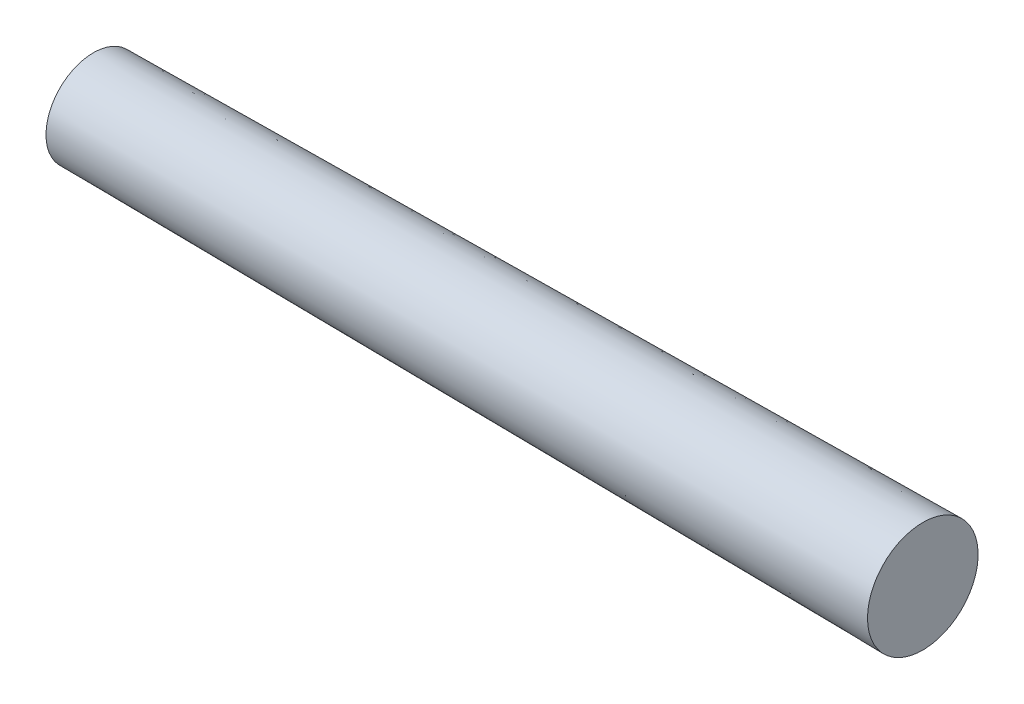
ISO-10303-21;
HEADER;
FILE_DESCRIPTION(('STEP AP214'),'2;1');
FILE_NAME('part.step','',(''),(''),'','','');
FILE_SCHEMA(('AUTOMOTIVE_DESIGN { 1 0 10303 214 1 1 1 1 }'));
ENDSEC;
DATA;
#1=APPLICATION_CONTEXT('core data for automotive mechanical design processes');
#2=APPLICATION_PROTOCOL_DEFINITION('international standard','automotive_design',2000,#1);
#3=PRODUCT_CONTEXT('',#1,'mechanical');
#4=PRODUCT('Part','Part','',(#3));
#5=PRODUCT_RELATED_PRODUCT_CATEGORY('part','',(#4));
#6=PRODUCT_DEFINITION_FORMATION('','',#4);
#7=PRODUCT_DEFINITION_CONTEXT('part definition',#1,'design');
#8=PRODUCT_DEFINITION('design','',#6,#7);
#9=PRODUCT_DEFINITION_SHAPE('','',#8);
#10=(LENGTH_UNIT() NAMED_UNIT(*) SI_UNIT(.MILLI.,.METRE.));
#11=(NAMED_UNIT(*) PLANE_ANGLE_UNIT() SI_UNIT($,.RADIAN.));
#12=(NAMED_UNIT(*) SI_UNIT($,.STERADIAN.) SOLID_ANGLE_UNIT());
#13=UNCERTAINTY_MEASURE_WITH_UNIT(LENGTH_MEASURE(1.E-05),#10,'distance_accuracy_value','');
#14=(GEOMETRIC_REPRESENTATION_CONTEXT(3) GLOBAL_UNCERTAINTY_ASSIGNED_CONTEXT((#13)) GLOBAL_UNIT_ASSIGNED_CONTEXT((#10,
#11,#12)) REPRESENTATION_CONTEXT('',''));
#15=CARTESIAN_POINT('',(0.,0.,0.));
#16=DIRECTION('',(0.,0.,1.));
#17=DIRECTION('',(1.,0.,0.));
#18=AXIS2_PLACEMENT_3D('',#15,#16,#17);
#19=CARTESIAN_POINT('',(0.,0.,0.));
#20=DIRECTION('',(1.,0.,0.));
#21=DIRECTION('',(0.,0.,-1.));
#22=AXIS2_PLACEMENT_3D('',#19,#20,#21);
#23=PLANE('',#22);
#24=CARTESIAN_POINT('',(0.,0.,0.));
#25=DIRECTION('',(-1.,0.,0.));
#26=DIRECTION('',(0.,0.,1.));
#27=AXIS2_PLACEMENT_3D('',#24,#25,#26);
#28=CIRCLE('',#27,6.);
#29=CARTESIAN_POINT('',(0.,0.,6.));
#30=VERTEX_POINT('',#29);
#31=EDGE_CURVE('E10',#30,#30,#28,.T.);
#32=ORIENTED_EDGE('',*,*,#31,.T.);
#33=EDGE_LOOP('',(#32));
#34=FACE_BOUND('',#33,.T.);
#35=ADVANCED_FACE('F35',(#34),#23,.F.);
#36=CARTESIAN_POINT('',(105.,0.,0.));
#37=DIRECTION('',(1.,0.,0.));
#38=DIRECTION('',(0.,0.,-1.));
#39=AXIS2_PLACEMENT_3D('',#36,#37,#38);
#40=CONICAL_SURFACE('',#39,7.,0.00952352159361286);
#41=ORIENTED_EDGE('',*,*,#31,.F.);
#42=EDGE_LOOP('',(#41));
#43=FACE_BOUND('',#42,.T.);
#44=CARTESIAN_POINT('',(105.,0.,0.));
#45=DIRECTION('',(-1.,0.,0.));
#46=DIRECTION('',(0.,0.,1.));
#47=AXIS2_PLACEMENT_3D('',#44,#45,#46);
#48=CIRCLE('',#47,7.);
#49=CARTESIAN_POINT('',(105.,0.,7.));
#50=VERTEX_POINT('',#49);
#51=EDGE_CURVE('E41',#50,#50,#48,.T.);
#52=ORIENTED_EDGE('',*,*,#51,.T.);
#53=EDGE_LOOP('',(#52));
#54=FACE_BOUND('',#53,.T.);
#55=ADVANCED_FACE('F47',(#43,#54),#40,.T.);
#56=CARTESIAN_POINT('',(105.,7.,0.));
#57=DIRECTION('',(-1.,0.,0.));
#58=DIRECTION('',(0.,0.,1.));
#59=AXIS2_PLACEMENT_3D('',#56,#57,#58);
#60=PLANE('',#59);
#61=ORIENTED_EDGE('',*,*,#51,.F.);
#62=EDGE_LOOP('',(#61));
#63=FACE_BOUND('',#62,.T.);
#64=ADVANCED_FACE('F49',(#63),#60,.F.);
#65=CLOSED_SHELL('',(#35,#55,#64));
#66=MANIFOLD_SOLID_BREP('B2',#65);
#67=ADVANCED_BREP_SHAPE_REPRESENTATION('',(#18,#66),#14);
#68=SHAPE_DEFINITION_REPRESENTATION(#9,#67);
ENDSEC;
END-ISO-10303-21;
